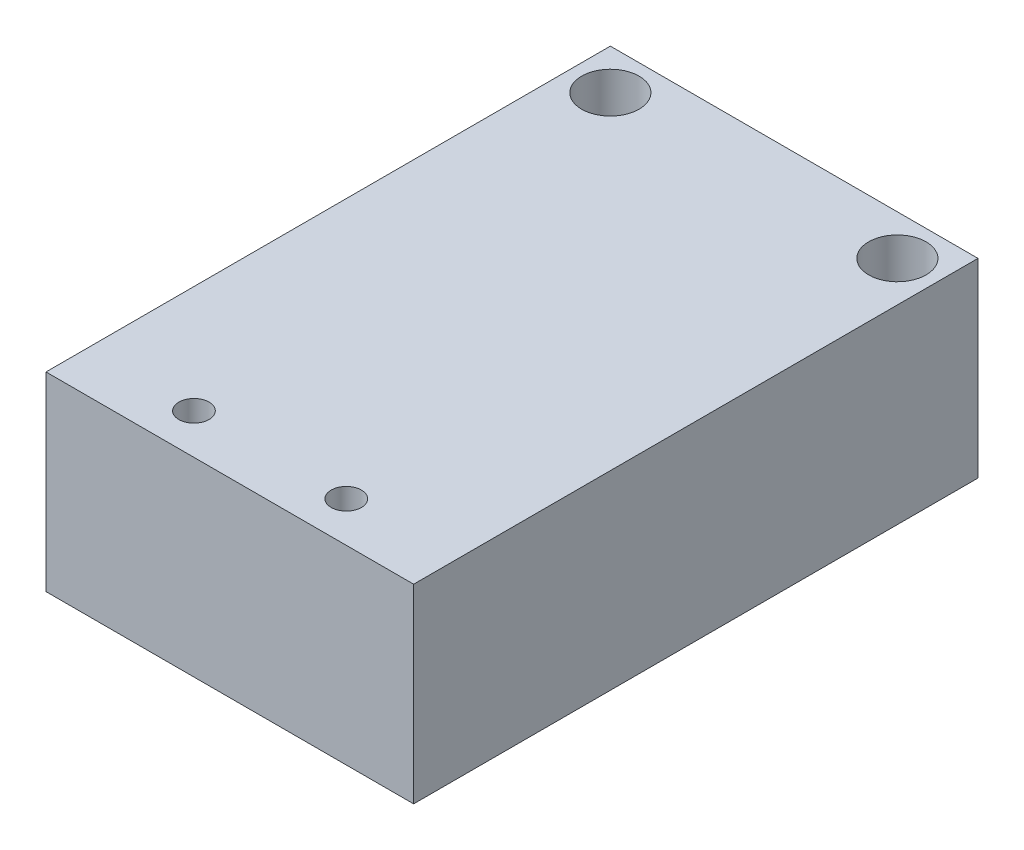
ISO-10303-21;
HEADER;
FILE_DESCRIPTION(('STEP AP214'),'2;1');
FILE_NAME('part.step','',(''),(''),'','','');
FILE_SCHEMA(('AUTOMOTIVE_DESIGN { 1 0 10303 214 1 1 1 1 }'));
ENDSEC;
DATA;
#1=APPLICATION_CONTEXT('core data for automotive mechanical design processes');
#2=APPLICATION_PROTOCOL_DEFINITION('international standard','automotive_design',2000,#1);
#3=PRODUCT_CONTEXT('',#1,'mechanical');
#4=PRODUCT('Part','Part','',(#3));
#5=PRODUCT_RELATED_PRODUCT_CATEGORY('part','',(#4));
#6=PRODUCT_DEFINITION_FORMATION('','',#4);
#7=PRODUCT_DEFINITION_CONTEXT('part definition',#1,'design');
#8=PRODUCT_DEFINITION('design','',#6,#7);
#9=PRODUCT_DEFINITION_SHAPE('','',#8);
#10=(LENGTH_UNIT() NAMED_UNIT(*) SI_UNIT(.MILLI.,.METRE.));
#11=(NAMED_UNIT(*) PLANE_ANGLE_UNIT() SI_UNIT($,.RADIAN.));
#12=(NAMED_UNIT(*) SI_UNIT($,.STERADIAN.) SOLID_ANGLE_UNIT());
#13=UNCERTAINTY_MEASURE_WITH_UNIT(LENGTH_MEASURE(1.E-05),#10,'distance_accuracy_value','');
#14=(GEOMETRIC_REPRESENTATION_CONTEXT(3) GLOBAL_UNCERTAINTY_ASSIGNED_CONTEXT((#13)) GLOBAL_UNIT_ASSIGNED_CONTEXT((#10,
#11,#12)) REPRESENTATION_CONTEXT('',''));
#15=CARTESIAN_POINT('',(0.,0.,0.));
#16=DIRECTION('',(0.,0.,1.));
#17=DIRECTION('',(1.,0.,0.));
#18=AXIS2_PLACEMENT_3D('',#15,#16,#17);
#19=CARTESIAN_POINT('',(7.239,7.493,11.1125));
#20=DIRECTION('',(-1.,0.,0.));
#21=DIRECTION('',(0.,0.,1.));
#22=AXIS2_PLACEMENT_3D('',#19,#20,#21);
#23=PLANE('',#22);
#24=DIRECTION('',(0.,0.,-1.));
#25=VECTOR('',#24,1.);
#26=CARTESIAN_POINT('',(7.239,0.,11.1125));
#27=LINE('',#26,#25);
#28=CARTESIAN_POINT('',(7.239,0.,11.1125));
#29=VERTEX_POINT('',#28);
#30=CARTESIAN_POINT('',(7.239,0.,-11.1125));
#31=VERTEX_POINT('',#30);
#32=EDGE_CURVE('E95',#29,#31,#27,.T.);
#33=ORIENTED_EDGE('',*,*,#32,.T.);
#34=DIRECTION('',(0.,-1.,0.));
#35=VECTOR('',#34,1.);
#36=CARTESIAN_POINT('',(7.239,7.493,-11.1125));
#37=LINE('',#36,#35);
#38=CARTESIAN_POINT('',(7.239,7.493,-11.1125));
#39=VERTEX_POINT('',#38);
#40=EDGE_CURVE('E11',#39,#31,#37,.T.);
#41=ORIENTED_EDGE('',*,*,#40,.F.);
#42=DIRECTION('',(0.,0.,-1.));
#43=VECTOR('',#42,1.);
#44=CARTESIAN_POINT('',(7.239,7.493,11.1125));
#45=LINE('',#44,#43);
#46=CARTESIAN_POINT('',(7.239,7.493,11.1125));
#47=VERTEX_POINT('',#46);
#48=EDGE_CURVE('E83',#47,#39,#45,.T.);
#49=ORIENTED_EDGE('',*,*,#48,.F.);
#50=DIRECTION('',(0.,-1.,0.));
#51=VECTOR('',#50,1.);
#52=CARTESIAN_POINT('',(7.239,7.493,11.1125));
#53=LINE('',#52,#51);
#54=EDGE_CURVE('E91',#47,#29,#53,.T.);
#55=ORIENTED_EDGE('',*,*,#54,.T.);
#56=EDGE_LOOP('',(#33,#41,#49,#55));
#57=FACE_BOUND('',#56,.T.);
#58=ADVANCED_FACE('F32',(#57),#23,.F.);
#59=CARTESIAN_POINT('',(-7.239,7.493,-11.1125));
#60=DIRECTION('',(0.,0.,1.));
#61=DIRECTION('',(1.,0.,0.));
#62=AXIS2_PLACEMENT_3D('',#59,#60,#61);
#63=PLANE('',#62);
#64=DIRECTION('',(-1.,0.,0.));
#65=VECTOR('',#64,1.);
#66=CARTESIAN_POINT('',(-7.239,0.,-11.1125));
#67=LINE('',#66,#65);
#68=CARTESIAN_POINT('',(-7.239,0.,-11.1125));
#69=VERTEX_POINT('',#68);
#70=EDGE_CURVE('E87',#31,#69,#67,.T.);
#71=ORIENTED_EDGE('',*,*,#70,.T.);
#72=DIRECTION('',(0.,-1.,0.));
#73=VECTOR('',#72,1.);
#74=CARTESIAN_POINT('',(-7.239,7.493,-11.1125));
#75=LINE('',#74,#73);
#76=CARTESIAN_POINT('',(-7.239,7.493,-11.1125));
#77=VERTEX_POINT('',#76);
#78=EDGE_CURVE('E40',#77,#69,#75,.T.);
#79=ORIENTED_EDGE('',*,*,#78,.F.);
#80=DIRECTION('',(-1.,0.,0.));
#81=VECTOR('',#80,1.);
#82=CARTESIAN_POINT('',(-7.239,7.493,-11.1125));
#83=LINE('',#82,#81);
#84=EDGE_CURVE('E78',#39,#77,#83,.T.);
#85=ORIENTED_EDGE('',*,*,#84,.F.);
#86=ORIENTED_EDGE('',*,*,#40,.T.);
#87=EDGE_LOOP('',(#71,#79,#85,#86));
#88=FACE_BOUND('',#87,.T.);
#89=ADVANCED_FACE('F86',(#88),#63,.F.);
#90=CARTESIAN_POINT('',(-7.239,7.493,11.1125));
#91=DIRECTION('',(1.,0.,0.));
#92=DIRECTION('',(0.,0.,-1.));
#93=AXIS2_PLACEMENT_3D('',#90,#91,#92);
#94=PLANE('',#93);
#95=DIRECTION('',(0.,0.,1.));
#96=VECTOR('',#95,1.);
#97=CARTESIAN_POINT('',(-7.239,0.,11.1125));
#98=LINE('',#97,#96);
#99=CARTESIAN_POINT('',(-7.239,0.,11.1125));
#100=VERTEX_POINT('',#99);
#101=EDGE_CURVE('E65',#69,#100,#98,.T.);
#102=ORIENTED_EDGE('',*,*,#101,.T.);
#103=DIRECTION('',(0.,-1.,0.));
#104=VECTOR('',#103,1.);
#105=CARTESIAN_POINT('',(-7.239,7.493,11.1125));
#106=LINE('',#105,#104);
#107=CARTESIAN_POINT('',(-7.239,7.493,11.1125));
#108=VERTEX_POINT('',#107);
#109=EDGE_CURVE('E88',#108,#100,#106,.T.);
#110=ORIENTED_EDGE('',*,*,#109,.F.);
#111=DIRECTION('',(0.,0.,1.));
#112=VECTOR('',#111,1.);
#113=CARTESIAN_POINT('',(-7.239,7.493,11.1125));
#114=LINE('',#113,#112);
#115=EDGE_CURVE('E81',#77,#108,#114,.T.);
#116=ORIENTED_EDGE('',*,*,#115,.F.);
#117=ORIENTED_EDGE('',*,*,#78,.T.);
#118=EDGE_LOOP('',(#102,#110,#116,#117));
#119=FACE_BOUND('',#118,.T.);
#120=ADVANCED_FACE('F89',(#119),#94,.F.);
#121=CARTESIAN_POINT('',(-7.239,7.493,11.1125));
#122=DIRECTION('',(0.,0.,-1.));
#123=DIRECTION('',(-1.,0.,0.));
#124=AXIS2_PLACEMENT_3D('',#121,#122,#123);
#125=PLANE('',#124);
#126=DIRECTION('',(1.,0.,0.));
#127=VECTOR('',#126,1.);
#128=CARTESIAN_POINT('',(-7.239,0.,11.1125));
#129=LINE('',#128,#127);
#130=EDGE_CURVE('E71',#100,#29,#129,.T.);
#131=ORIENTED_EDGE('',*,*,#130,.T.);
#132=ORIENTED_EDGE('',*,*,#54,.F.);
#133=DIRECTION('',(1.,0.,0.));
#134=VECTOR('',#133,1.);
#135=CARTESIAN_POINT('',(-7.239,7.493,11.1125));
#136=LINE('',#135,#134);
#137=EDGE_CURVE('E48',#108,#47,#136,.T.);
#138=ORIENTED_EDGE('',*,*,#137,.F.);
#139=ORIENTED_EDGE('',*,*,#109,.T.);
#140=EDGE_LOOP('',(#131,#132,#138,#139));
#141=FACE_BOUND('',#140,.T.);
#142=ADVANCED_FACE('F103',(#141),#125,.F.);
#143=CARTESIAN_POINT('',(7.239,7.493,-11.1125));
#144=DIRECTION('',(0.,-1.,0.));
#145=DIRECTION('',(0.,0.,-1.));
#146=AXIS2_PLACEMENT_3D('',#143,#144,#145);
#147=PLANE('',#146);
#148=CARTESIAN_POINT('',(-5.6515,7.493,-9.525));
#149=DIRECTION('',(0.,1.,0.));
#150=DIRECTION('',(0.,0.,1.));
#151=AXIS2_PLACEMENT_3D('',#148,#149,#150);
#152=CIRCLE('',#151,1.13029999999999);
#153=CARTESIAN_POINT('',(-5.6515,7.493,-8.39470000000001));
#154=VERTEX_POINT('',#153);
#155=EDGE_CURVE('E129',#154,#154,#152,.T.);
#156=ORIENTED_EDGE('',*,*,#155,.F.);
#157=EDGE_LOOP('',(#156));
#158=FACE_BOUND('',#157,.T.);
#159=CARTESIAN_POINT('',(5.6515,7.493,-9.525));
#160=DIRECTION('',(0.,1.,0.));
#161=DIRECTION('',(0.,0.,1.));
#162=AXIS2_PLACEMENT_3D('',#159,#160,#161);
#163=CIRCLE('',#162,1.13029999999999);
#164=CARTESIAN_POINT('',(5.6515,7.493,-8.39470000000001));
#165=VERTEX_POINT('',#164);
#166=EDGE_CURVE('E123',#165,#165,#163,.T.);
#167=ORIENTED_EDGE('',*,*,#166,.F.);
#168=EDGE_LOOP('',(#167));
#169=FACE_BOUND('',#168,.T.);
#170=CARTESIAN_POINT('',(-3.,7.493,9.525));
#171=DIRECTION('',(0.,1.,0.));
#172=DIRECTION('',(0.,0.,1.));
#173=AXIS2_PLACEMENT_3D('',#170,#171,#172);
#174=CIRCLE('',#173,0.595629999999988);
#175=CARTESIAN_POINT('',(-3.,7.493,10.12063));
#176=VERTEX_POINT('',#175);
#177=EDGE_CURVE('E117',#176,#176,#174,.T.);
#178=ORIENTED_EDGE('',*,*,#177,.F.);
#179=EDGE_LOOP('',(#178));
#180=FACE_BOUND('',#179,.T.);
#181=CARTESIAN_POINT('',(3.,7.493,9.525));
#182=DIRECTION('',(0.,1.,0.));
#183=DIRECTION('',(0.,0.,1.));
#184=AXIS2_PLACEMENT_3D('',#181,#182,#183);
#185=CIRCLE('',#184,0.595629999999988);
#186=CARTESIAN_POINT('',(3.,7.493,10.12063));
#187=VERTEX_POINT('',#186);
#188=EDGE_CURVE('E111',#187,#187,#185,.T.);
#189=ORIENTED_EDGE('',*,*,#188,.F.);
#190=EDGE_LOOP('',(#189));
#191=FACE_BOUND('',#190,.T.);
#192=ORIENTED_EDGE('',*,*,#48,.T.);
#193=ORIENTED_EDGE('',*,*,#84,.T.);
#194=ORIENTED_EDGE('',*,*,#115,.T.);
#195=ORIENTED_EDGE('',*,*,#137,.T.);
#196=EDGE_LOOP('',(#192,#193,#194,#195));
#197=FACE_BOUND('',#196,.T.);
#198=ADVANCED_FACE('F79',(#158,#169,#180,#191,#197),#147,.F.);
#199=CARTESIAN_POINT('',(7.239,0.,-11.1125));
#200=DIRECTION('',(0.,-1.,0.));
#201=DIRECTION('',(0.,0.,-1.));
#202=AXIS2_PLACEMENT_3D('',#199,#200,#201);
#203=PLANE('',#202);
#204=CARTESIAN_POINT('',(-5.6515,0.,-9.525));
#205=DIRECTION('',(0.,1.,0.));
#206=DIRECTION('',(0.,0.,1.));
#207=AXIS2_PLACEMENT_3D('',#204,#205,#206);
#208=CIRCLE('',#207,1.1303);
#209=CARTESIAN_POINT('',(-5.6515,0.,-8.39470000000001));
#210=VERTEX_POINT('',#209);
#211=EDGE_CURVE('E126',#210,#210,#208,.T.);
#212=ORIENTED_EDGE('',*,*,#211,.T.);
#213=EDGE_LOOP('',(#212));
#214=FACE_BOUND('',#213,.T.);
#215=CARTESIAN_POINT('',(5.6515,0.,-9.525));
#216=DIRECTION('',(0.,1.,0.));
#217=DIRECTION('',(0.,0.,1.));
#218=AXIS2_PLACEMENT_3D('',#215,#216,#217);
#219=CIRCLE('',#218,1.1303);
#220=CARTESIAN_POINT('',(5.6515,0.,-8.39470000000001));
#221=VERTEX_POINT('',#220);
#222=EDGE_CURVE('E120',#221,#221,#219,.T.);
#223=ORIENTED_EDGE('',*,*,#222,.T.);
#224=EDGE_LOOP('',(#223));
#225=FACE_BOUND('',#224,.T.);
#226=CARTESIAN_POINT('',(-3.,0.,9.525));
#227=DIRECTION('',(0.,1.,0.));
#228=DIRECTION('',(0.,0.,1.));
#229=AXIS2_PLACEMENT_3D('',#226,#227,#228);
#230=CIRCLE('',#229,0.595629999999998);
#231=CARTESIAN_POINT('',(-3.,0.,10.12063));
#232=VERTEX_POINT('',#231);
#233=EDGE_CURVE('E114',#232,#232,#230,.T.);
#234=ORIENTED_EDGE('',*,*,#233,.T.);
#235=EDGE_LOOP('',(#234));
#236=FACE_BOUND('',#235,.T.);
#237=CARTESIAN_POINT('',(3.,0.,9.525));
#238=DIRECTION('',(0.,1.,0.));
#239=DIRECTION('',(0.,0.,1.));
#240=AXIS2_PLACEMENT_3D('',#237,#238,#239);
#241=CIRCLE('',#240,0.595629999999998);
#242=CARTESIAN_POINT('',(3.,0.,10.12063));
#243=VERTEX_POINT('',#242);
#244=EDGE_CURVE('E98',#243,#243,#241,.T.);
#245=ORIENTED_EDGE('',*,*,#244,.T.);
#246=EDGE_LOOP('',(#245));
#247=FACE_BOUND('',#246,.T.);
#248=ORIENTED_EDGE('',*,*,#32,.F.);
#249=ORIENTED_EDGE('',*,*,#130,.F.);
#250=ORIENTED_EDGE('',*,*,#101,.F.);
#251=ORIENTED_EDGE('',*,*,#70,.F.);
#252=EDGE_LOOP('',(#248,#249,#250,#251));
#253=FACE_BOUND('',#252,.T.);
#254=ADVANCED_FACE('F106',(#214,#225,#236,#247,#253),#203,.T.);
#255=CARTESIAN_POINT('',(3.,7.493,9.525));
#256=DIRECTION('',(0.,1.,0.));
#257=DIRECTION('',(0.,0.,1.));
#258=AXIS2_PLACEMENT_3D('',#255,#256,#257);
#259=CYLINDRICAL_SURFACE('',#258,0.595629999999993);
#260=ORIENTED_EDGE('',*,*,#244,.F.);
#261=EDGE_LOOP('',(#260));
#262=FACE_BOUND('',#261,.T.);
#263=ORIENTED_EDGE('',*,*,#188,.T.);
#264=EDGE_LOOP('',(#263));
#265=FACE_BOUND('',#264,.T.);
#266=ADVANCED_FACE('F144',(#262,#265),#259,.F.);
#267=CARTESIAN_POINT('',(-3.,7.493,9.525));
#268=DIRECTION('',(0.,1.,0.));
#269=DIRECTION('',(0.,0.,1.));
#270=AXIS2_PLACEMENT_3D('',#267,#268,#269);
#271=CYLINDRICAL_SURFACE('',#270,0.595629999999993);
#272=ORIENTED_EDGE('',*,*,#233,.F.);
#273=EDGE_LOOP('',(#272));
#274=FACE_BOUND('',#273,.T.);
#275=ORIENTED_EDGE('',*,*,#177,.T.);
#276=EDGE_LOOP('',(#275));
#277=FACE_BOUND('',#276,.T.);
#278=ADVANCED_FACE('F146',(#274,#277),#271,.F.);
#279=CARTESIAN_POINT('',(5.6515,7.493,-9.525));
#280=DIRECTION('',(0.,1.,0.));
#281=DIRECTION('',(0.,0.,1.));
#282=AXIS2_PLACEMENT_3D('',#279,#280,#281);
#283=CYLINDRICAL_SURFACE('',#282,1.13029999999999);
#284=ORIENTED_EDGE('',*,*,#222,.F.);
#285=EDGE_LOOP('',(#284));
#286=FACE_BOUND('',#285,.T.);
#287=ORIENTED_EDGE('',*,*,#166,.T.);
#288=EDGE_LOOP('',(#287));
#289=FACE_BOUND('',#288,.T.);
#290=ADVANCED_FACE('F153',(#286,#289),#283,.F.);
#291=CARTESIAN_POINT('',(-5.6515,7.493,-9.525));
#292=DIRECTION('',(0.,1.,0.));
#293=DIRECTION('',(0.,0.,1.));
#294=AXIS2_PLACEMENT_3D('',#291,#292,#293);
#295=CYLINDRICAL_SURFACE('',#294,1.13029999999999);
#296=ORIENTED_EDGE('',*,*,#211,.F.);
#297=EDGE_LOOP('',(#296));
#298=FACE_BOUND('',#297,.T.);
#299=ORIENTED_EDGE('',*,*,#155,.T.);
#300=EDGE_LOOP('',(#299));
#301=FACE_BOUND('',#300,.T.);
#302=ADVANCED_FACE('F133',(#298,#301),#295,.F.);
#303=CLOSED_SHELL('',(#58,#89,#120,#142,#198,#254,#266,#278,#290,#302));
#304=MANIFOLD_SOLID_BREP('B2',#303);
#305=ADVANCED_BREP_SHAPE_REPRESENTATION('',(#18,#304),#14);
#306=SHAPE_DEFINITION_REPRESENTATION(#9,#305);
ENDSEC;
END-ISO-10303-21;
